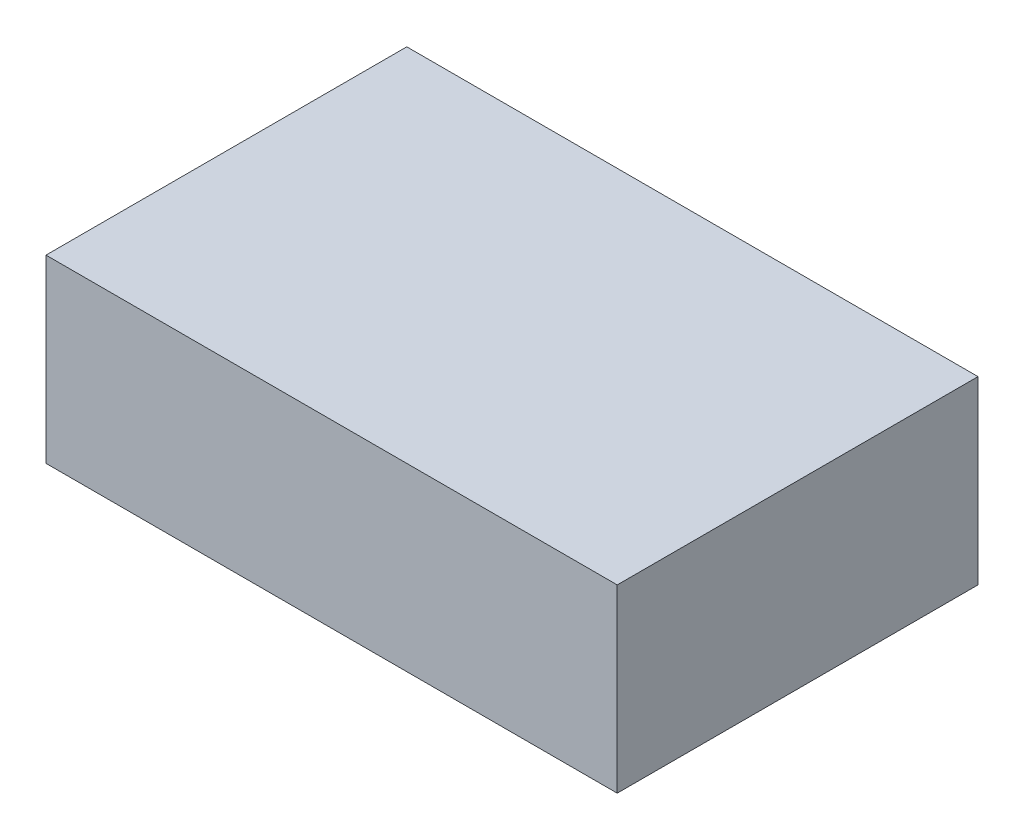
ISO-10303-21;
HEADER;
FILE_DESCRIPTION(('STEP AP214'),'2;1');
FILE_NAME('part.step','',(''),(''),'','','');
FILE_SCHEMA(('AUTOMOTIVE_DESIGN { 1 0 10303 214 1 1 1 1 }'));
ENDSEC;
DATA;
#1=APPLICATION_CONTEXT('core data for automotive mechanical design processes');
#2=APPLICATION_PROTOCOL_DEFINITION('international standard','automotive_design',2000,#1);
#3=PRODUCT_CONTEXT('',#1,'mechanical');
#4=PRODUCT('Part','Part','',(#3));
#5=PRODUCT_RELATED_PRODUCT_CATEGORY('part','',(#4));
#6=PRODUCT_DEFINITION_FORMATION('','',#4);
#7=PRODUCT_DEFINITION_CONTEXT('part definition',#1,'design');
#8=PRODUCT_DEFINITION('design','',#6,#7);
#9=PRODUCT_DEFINITION_SHAPE('','',#8);
#10=(LENGTH_UNIT() NAMED_UNIT(*) SI_UNIT(.MILLI.,.METRE.));
#11=(NAMED_UNIT(*) PLANE_ANGLE_UNIT() SI_UNIT($,.RADIAN.));
#12=(NAMED_UNIT(*) SI_UNIT($,.STERADIAN.) SOLID_ANGLE_UNIT());
#13=UNCERTAINTY_MEASURE_WITH_UNIT(LENGTH_MEASURE(1.E-05),#10,'distance_accuracy_value','');
#14=(GEOMETRIC_REPRESENTATION_CONTEXT(3) GLOBAL_UNCERTAINTY_ASSIGNED_CONTEXT((#13)) GLOBAL_UNIT_ASSIGNED_CONTEXT((#10,
#11,#12)) REPRESENTATION_CONTEXT('',''));
#15=CARTESIAN_POINT('',(0.,0.,0.));
#16=DIRECTION('',(0.,0.,1.));
#17=DIRECTION('',(1.,0.,0.));
#18=AXIS2_PLACEMENT_3D('',#15,#16,#17);
#19=CARTESIAN_POINT('',(190.,120.,120.));
#20=DIRECTION('',(-1.,0.,0.));
#21=DIRECTION('',(0.,0.,1.));
#22=AXIS2_PLACEMENT_3D('',#19,#20,#21);
#23=PLANE('',#22);
#24=DIRECTION('',(0.,0.,-1.));
#25=VECTOR('',#24,1.);
#26=CARTESIAN_POINT('',(190.,0.,120.));
#27=LINE('',#26,#25);
#28=CARTESIAN_POINT('',(190.,0.,120.));
#29=VERTEX_POINT('',#28);
#30=CARTESIAN_POINT('',(190.,0.,-120.));
#31=VERTEX_POINT('',#30);
#32=EDGE_CURVE('E107',#29,#31,#27,.T.);
#33=ORIENTED_EDGE('',*,*,#32,.T.);
#34=DIRECTION('',(0.,-1.,0.));
#35=VECTOR('',#34,1.);
#36=CARTESIAN_POINT('',(190.,120.,-120.));
#37=LINE('',#36,#35);
#38=CARTESIAN_POINT('',(190.,120.,-120.));
#39=VERTEX_POINT('',#38);
#40=EDGE_CURVE('E11',#39,#31,#37,.T.);
#41=ORIENTED_EDGE('',*,*,#40,.F.);
#42=DIRECTION('',(0.,0.,-1.));
#43=VECTOR('',#42,1.);
#44=CARTESIAN_POINT('',(190.,120.,120.));
#45=LINE('',#44,#43);
#46=CARTESIAN_POINT('',(190.,120.,120.));
#47=VERTEX_POINT('',#46);
#48=EDGE_CURVE('E91',#47,#39,#45,.T.);
#49=ORIENTED_EDGE('',*,*,#48,.F.);
#50=DIRECTION('',(0.,-1.,0.));
#51=VECTOR('',#50,1.);
#52=CARTESIAN_POINT('',(190.,120.,120.));
#53=LINE('',#52,#51);
#54=EDGE_CURVE('E103',#47,#29,#53,.T.);
#55=ORIENTED_EDGE('',*,*,#54,.T.);
#56=EDGE_LOOP('',(#33,#41,#49,#55));
#57=FACE_BOUND('',#56,.T.);
#58=ADVANCED_FACE('F39',(#57),#23,.F.);
#59=CARTESIAN_POINT('',(-190.,120.,-120.));
#60=DIRECTION('',(0.,0.,1.));
#61=DIRECTION('',(1.,0.,0.));
#62=AXIS2_PLACEMENT_3D('',#59,#60,#61);
#63=PLANE('',#62);
#64=DIRECTION('',(-1.,0.,0.));
#65=VECTOR('',#64,1.);
#66=CARTESIAN_POINT('',(-190.,0.,-120.));
#67=LINE('',#66,#65);
#68=CARTESIAN_POINT('',(-190.,0.,-120.));
#69=VERTEX_POINT('',#68);
#70=EDGE_CURVE('E96',#31,#69,#67,.T.);
#71=ORIENTED_EDGE('',*,*,#70,.T.);
#72=DIRECTION('',(0.,-1.,0.));
#73=VECTOR('',#72,1.);
#74=CARTESIAN_POINT('',(-190.,120.,-120.));
#75=LINE('',#74,#73);
#76=CARTESIAN_POINT('',(-190.,120.,-120.));
#77=VERTEX_POINT('',#76);
#78=EDGE_CURVE('E48',#77,#69,#75,.T.);
#79=ORIENTED_EDGE('',*,*,#78,.F.);
#80=DIRECTION('',(-1.,0.,0.));
#81=VECTOR('',#80,1.);
#82=CARTESIAN_POINT('',(-190.,120.,-120.));
#83=LINE('',#82,#81);
#84=EDGE_CURVE('E86',#39,#77,#83,.T.);
#85=ORIENTED_EDGE('',*,*,#84,.F.);
#86=ORIENTED_EDGE('',*,*,#40,.T.);
#87=EDGE_LOOP('',(#71,#79,#85,#86));
#88=FACE_BOUND('',#87,.T.);
#89=ADVANCED_FACE('F95',(#88),#63,.F.);
#90=CARTESIAN_POINT('',(-190.,120.,120.));
#91=DIRECTION('',(1.,0.,0.));
#92=DIRECTION('',(0.,0.,-1.));
#93=AXIS2_PLACEMENT_3D('',#90,#91,#92);
#94=PLANE('',#93);
#95=DIRECTION('',(0.,0.,1.));
#96=VECTOR('',#95,1.);
#97=CARTESIAN_POINT('',(-190.,0.,120.));
#98=LINE('',#97,#96);
#99=CARTESIAN_POINT('',(-190.,0.,120.));
#100=VERTEX_POINT('',#99);
#101=EDGE_CURVE('E73',#69,#100,#98,.T.);
#102=ORIENTED_EDGE('',*,*,#101,.T.);
#103=DIRECTION('',(0.,-1.,0.));
#104=VECTOR('',#103,1.);
#105=CARTESIAN_POINT('',(-190.,120.,120.));
#106=LINE('',#105,#104);
#107=CARTESIAN_POINT('',(-190.,120.,120.));
#108=VERTEX_POINT('',#107);
#109=EDGE_CURVE('E98',#108,#100,#106,.T.);
#110=ORIENTED_EDGE('',*,*,#109,.F.);
#111=DIRECTION('',(0.,0.,1.));
#112=VECTOR('',#111,1.);
#113=CARTESIAN_POINT('',(-190.,120.,120.));
#114=LINE('',#113,#112);
#115=EDGE_CURVE('E89',#77,#108,#114,.T.);
#116=ORIENTED_EDGE('',*,*,#115,.F.);
#117=ORIENTED_EDGE('',*,*,#78,.T.);
#118=EDGE_LOOP('',(#102,#110,#116,#117));
#119=FACE_BOUND('',#118,.T.);
#120=ADVANCED_FACE('F99',(#119),#94,.F.);
#121=CARTESIAN_POINT('',(-190.,120.,120.));
#122=DIRECTION('',(0.,0.,-1.));
#123=DIRECTION('',(-1.,0.,0.));
#124=AXIS2_PLACEMENT_3D('',#121,#122,#123);
#125=PLANE('',#124);
#126=DIRECTION('',(1.,0.,0.));
#127=VECTOR('',#126,1.);
#128=CARTESIAN_POINT('',(-190.,0.,120.));
#129=LINE('',#128,#127);
#130=EDGE_CURVE('E79',#100,#29,#129,.T.);
#131=ORIENTED_EDGE('',*,*,#130,.T.);
#132=ORIENTED_EDGE('',*,*,#54,.F.);
#133=DIRECTION('',(1.,0.,0.));
#134=VECTOR('',#133,1.);
#135=CARTESIAN_POINT('',(-190.,120.,120.));
#136=LINE('',#135,#134);
#137=EDGE_CURVE('E56',#108,#47,#136,.T.);
#138=ORIENTED_EDGE('',*,*,#137,.F.);
#139=ORIENTED_EDGE('',*,*,#109,.T.);
#140=EDGE_LOOP('',(#131,#132,#138,#139));
#141=FACE_BOUND('',#140,.T.);
#142=ADVANCED_FACE('F120',(#141),#125,.F.);
#143=CARTESIAN_POINT('',(0.,120.,0.));
#144=DIRECTION('',(0.,-1.,0.));
#145=DIRECTION('',(0.,0.,-1.));
#146=AXIS2_PLACEMENT_3D('',#143,#144,#145);
#147=PLANE('',#146);
#148=ORIENTED_EDGE('',*,*,#48,.T.);
#149=ORIENTED_EDGE('',*,*,#84,.T.);
#150=ORIENTED_EDGE('',*,*,#115,.T.);
#151=ORIENTED_EDGE('',*,*,#137,.T.);
#152=EDGE_LOOP('',(#148,#149,#150,#151));
#153=FACE_BOUND('',#152,.T.);
#154=ADVANCED_FACE('F87',(#153),#147,.F.);
#155=CARTESIAN_POINT('',(0.,0.,0.));
#156=DIRECTION('',(0.,-1.,0.));
#157=DIRECTION('',(0.,0.,-1.));
#158=AXIS2_PLACEMENT_3D('',#155,#156,#157);
#159=PLANE('',#158);
#160=ORIENTED_EDGE('',*,*,#32,.F.);
#161=ORIENTED_EDGE('',*,*,#130,.F.);
#162=ORIENTED_EDGE('',*,*,#101,.F.);
#163=ORIENTED_EDGE('',*,*,#70,.F.);
#164=EDGE_LOOP('',(#160,#161,#162,#163));
#165=FACE_BOUND('',#164,.T.);
#166=ADVANCED_FACE('F123',(#165),#159,.T.);
#167=CLOSED_SHELL('',(#58,#89,#120,#142,#154,#166));
#168=MANIFOLD_SOLID_BREP('B2',#167);
#169=ADVANCED_BREP_SHAPE_REPRESENTATION('',(#18,#168),#14);
#170=SHAPE_DEFINITION_REPRESENTATION(#9,#169);
ENDSEC;
END-ISO-10303-21;
